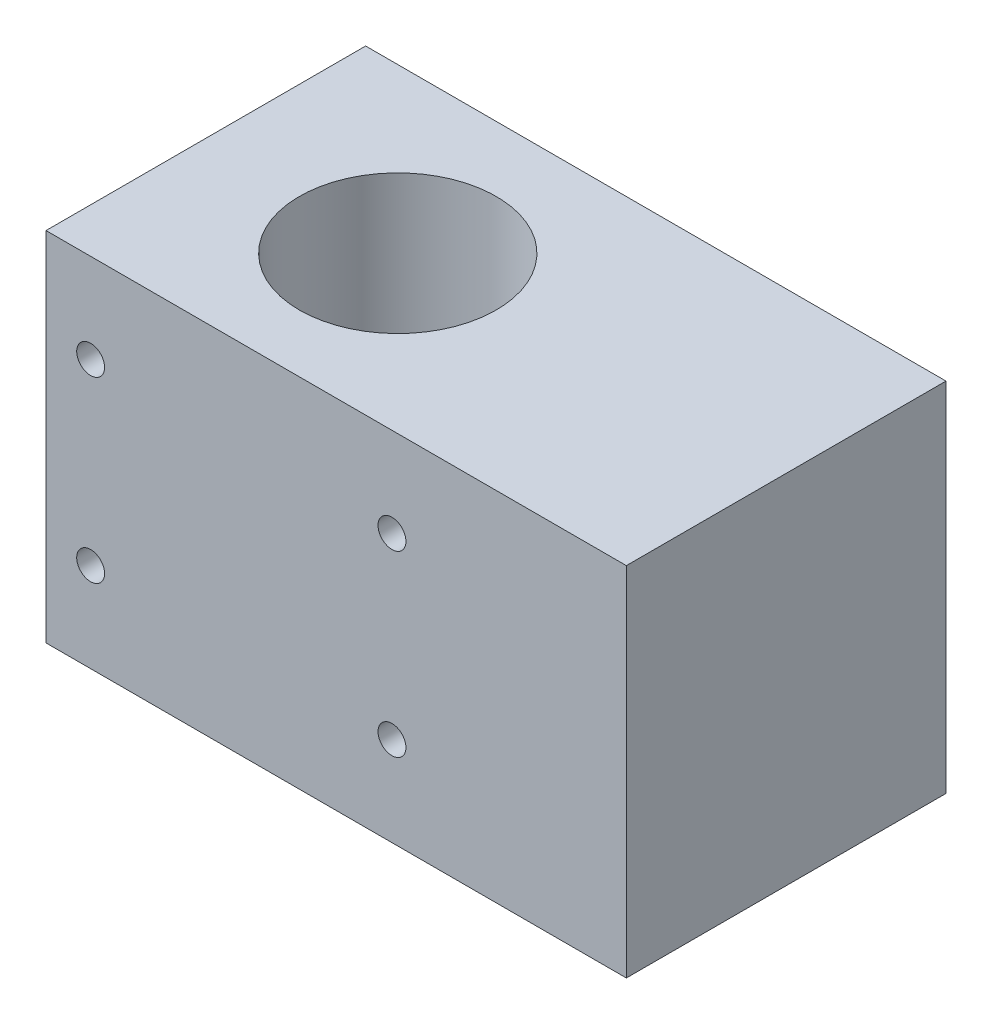
ISO-10303-21;
HEADER;
FILE_DESCRIPTION(('STEP AP214'),'2;1');
FILE_NAME('part.step','',(''),(''),'','','');
FILE_SCHEMA(('AUTOMOTIVE_DESIGN { 1 0 10303 214 1 1 1 1 }'));
ENDSEC;
DATA;
#1=APPLICATION_CONTEXT('core data for automotive mechanical design processes');
#2=APPLICATION_PROTOCOL_DEFINITION('international standard','automotive_design',2000,#1);
#3=PRODUCT_CONTEXT('',#1,'mechanical');
#4=PRODUCT('Part','Part','',(#3));
#5=PRODUCT_RELATED_PRODUCT_CATEGORY('part','',(#4));
#6=PRODUCT_DEFINITION_FORMATION('','',#4);
#7=PRODUCT_DEFINITION_CONTEXT('part definition',#1,'design');
#8=PRODUCT_DEFINITION('design','',#6,#7);
#9=PRODUCT_DEFINITION_SHAPE('','',#8);
#10=(LENGTH_UNIT() NAMED_UNIT(*) SI_UNIT(.MILLI.,.METRE.));
#11=(NAMED_UNIT(*) PLANE_ANGLE_UNIT() SI_UNIT($,.RADIAN.));
#12=(NAMED_UNIT(*) SI_UNIT($,.STERADIAN.) SOLID_ANGLE_UNIT());
#13=UNCERTAINTY_MEASURE_WITH_UNIT(LENGTH_MEASURE(1.E-05),#10,'distance_accuracy_value','');
#14=(GEOMETRIC_REPRESENTATION_CONTEXT(3) GLOBAL_UNCERTAINTY_ASSIGNED_CONTEXT((#13)) GLOBAL_UNIT_ASSIGNED_CONTEXT((#10,
#11,#12)) REPRESENTATION_CONTEXT('',''));
#15=CARTESIAN_POINT('',(0.,0.,0.));
#16=DIRECTION('',(0.,0.,1.));
#17=DIRECTION('',(1.,0.,0.));
#18=AXIS2_PLACEMENT_3D('',#15,#16,#17);
#19=CARTESIAN_POINT('',(82.55,0.,45.466));
#20=DIRECTION('',(0.,1.,0.));
#21=DIRECTION('',(0.,0.,1.));
#22=AXIS2_PLACEMENT_3D('',#19,#20,#21);
#23=PLANE('',#22);
#24=CARTESIAN_POINT('',(74.295,0.,23.241));
#25=DIRECTION('',(0.,-1.,0.));
#26=DIRECTION('',(0.,0.,-1.));
#27=AXIS2_PLACEMENT_3D('',#24,#25,#26);
#28=CIRCLE('',#27,4.21639999999999);
#29=CARTESIAN_POINT('',(74.295,0.,19.0246));
#30=VERTEX_POINT('',#29);
#31=EDGE_CURVE('E119',#30,#30,#28,.T.);
#32=ORIENTED_EDGE('',*,*,#31,.F.);
#33=EDGE_LOOP('',(#32));
#34=FACE_BOUND('',#33,.T.);
#35=CARTESIAN_POINT('',(27.813,0.,23.241));
#36=DIRECTION('',(0.,1.,0.));
#37=DIRECTION('',(0.,0.,1.));
#38=AXIS2_PLACEMENT_3D('',#35,#36,#37);
#39=CIRCLE('',#38,14.);
#40=CARTESIAN_POINT('',(27.813,0.,37.241));
#41=VERTEX_POINT('',#40);
#42=EDGE_CURVE('E172',#41,#41,#39,.T.);
#43=ORIENTED_EDGE('',*,*,#42,.T.);
#44=EDGE_LOOP('',(#43));
#45=FACE_BOUND('',#44,.T.);
#46=DIRECTION('',(1.,0.,0.));
#47=VECTOR('',#46,1.);
#48=CARTESIAN_POINT('',(82.55,0.,0.));
#49=LINE('',#48,#47);
#50=CARTESIAN_POINT('',(0.,0.,0.));
#51=VERTEX_POINT('',#50);
#52=CARTESIAN_POINT('',(82.55,0.,0.));
#53=VERTEX_POINT('',#52);
#54=EDGE_CURVE('E175',#51,#53,#49,.T.);
#55=ORIENTED_EDGE('',*,*,#54,.T.);
#56=DIRECTION('',(0.,0.,-1.));
#57=VECTOR('',#56,1.);
#58=CARTESIAN_POINT('',(82.55,0.,45.466));
#59=LINE('',#58,#57);
#60=CARTESIAN_POINT('',(82.55,0.,45.466));
#61=VERTEX_POINT('',#60);
#62=EDGE_CURVE('E11',#61,#53,#59,.T.);
#63=ORIENTED_EDGE('',*,*,#62,.F.);
#64=DIRECTION('',(1.,0.,0.));
#65=VECTOR('',#64,1.);
#66=CARTESIAN_POINT('',(82.55,0.,45.466));
#67=LINE('',#66,#65);
#68=CARTESIAN_POINT('',(0.,0.,45.466));
#69=VERTEX_POINT('',#68);
#70=EDGE_CURVE('E178',#69,#61,#67,.T.);
#71=ORIENTED_EDGE('',*,*,#70,.F.);
#72=DIRECTION('',(0.,0.,-1.));
#73=VECTOR('',#72,1.);
#74=CARTESIAN_POINT('',(0.,0.,45.466));
#75=LINE('',#74,#73);
#76=EDGE_CURVE('E184',#69,#51,#75,.T.);
#77=ORIENTED_EDGE('',*,*,#76,.T.);
#78=EDGE_LOOP('',(#55,#63,#71,#77));
#79=FACE_BOUND('',#78,.T.);
#80=ADVANCED_FACE('F33',(#34,#45,#79),#23,.F.);
#81=CARTESIAN_POINT('',(82.55,50.8,45.466));
#82=DIRECTION('',(-1.,0.,0.));
#83=DIRECTION('',(0.,0.,1.));
#84=AXIS2_PLACEMENT_3D('',#81,#82,#83);
#85=PLANE('',#84);
#86=DIRECTION('',(0.,1.,0.));
#87=VECTOR('',#86,1.);
#88=CARTESIAN_POINT('',(82.55,50.8,0.));
#89=LINE('',#88,#87);
#90=CARTESIAN_POINT('',(82.55,50.8,0.));
#91=VERTEX_POINT('',#90);
#92=EDGE_CURVE('E187',#53,#91,#89,.T.);
#93=ORIENTED_EDGE('',*,*,#92,.T.);
#94=DIRECTION('',(0.,0.,-1.));
#95=VECTOR('',#94,1.);
#96=CARTESIAN_POINT('',(82.55,50.8,45.466));
#97=LINE('',#96,#95);
#98=CARTESIAN_POINT('',(82.55,50.8,45.466));
#99=VERTEX_POINT('',#98);
#100=EDGE_CURVE('E41',#99,#91,#97,.T.);
#101=ORIENTED_EDGE('',*,*,#100,.F.);
#102=DIRECTION('',(0.,1.,0.));
#103=VECTOR('',#102,1.);
#104=CARTESIAN_POINT('',(82.55,50.8,45.466));
#105=LINE('',#104,#103);
#106=EDGE_CURVE('E80',#61,#99,#105,.T.);
#107=ORIENTED_EDGE('',*,*,#106,.F.);
#108=ORIENTED_EDGE('',*,*,#62,.T.);
#109=EDGE_LOOP('',(#93,#101,#107,#108));
#110=FACE_BOUND('',#109,.T.);
#111=ADVANCED_FACE('F211',(#110),#85,.F.);
#112=CARTESIAN_POINT('',(0.,50.8,45.466));
#113=DIRECTION('',(0.,-1.,0.));
#114=DIRECTION('',(0.,0.,-1.));
#115=AXIS2_PLACEMENT_3D('',#112,#113,#114);
#116=PLANE('',#115);
#117=CARTESIAN_POINT('',(27.813,50.8,23.241));
#118=DIRECTION('',(0.,1.,0.));
#119=DIRECTION('',(0.,0.,1.));
#120=AXIS2_PLACEMENT_3D('',#117,#118,#119);
#121=CIRCLE('',#120,14.);
#122=CARTESIAN_POINT('',(27.813,50.8,37.241));
#123=VERTEX_POINT('',#122);
#124=EDGE_CURVE('E171',#123,#123,#121,.T.);
#125=ORIENTED_EDGE('',*,*,#124,.F.);
#126=EDGE_LOOP('',(#125));
#127=FACE_BOUND('',#126,.T.);
#128=DIRECTION('',(-1.,0.,0.));
#129=VECTOR('',#128,1.);
#130=CARTESIAN_POINT('',(0.,50.8,0.));
#131=LINE('',#130,#129);
#132=CARTESIAN_POINT('',(0.,50.8,0.));
#133=VERTEX_POINT('',#132);
#134=EDGE_CURVE('E67',#91,#133,#131,.T.);
#135=ORIENTED_EDGE('',*,*,#134,.T.);
#136=DIRECTION('',(0.,0.,-1.));
#137=VECTOR('',#136,1.);
#138=CARTESIAN_POINT('',(0.,50.8,45.466));
#139=LINE('',#138,#137);
#140=CARTESIAN_POINT('',(0.,50.8,45.466));
#141=VERTEX_POINT('',#140);
#142=EDGE_CURVE('E192',#141,#133,#139,.T.);
#143=ORIENTED_EDGE('',*,*,#142,.F.);
#144=DIRECTION('',(-1.,0.,0.));
#145=VECTOR('',#144,1.);
#146=CARTESIAN_POINT('',(0.,50.8,45.466));
#147=LINE('',#146,#145);
#148=EDGE_CURVE('E181',#99,#141,#147,.T.);
#149=ORIENTED_EDGE('',*,*,#148,.F.);
#150=ORIENTED_EDGE('',*,*,#100,.T.);
#151=EDGE_LOOP('',(#135,#143,#149,#150));
#152=FACE_BOUND('',#151,.T.);
#153=ADVANCED_FACE('F194',(#127,#152),#116,.F.);
#154=CARTESIAN_POINT('',(0.,0.,45.466));
#155=DIRECTION('',(1.,0.,0.));
#156=DIRECTION('',(0.,0.,-1.));
#157=AXIS2_PLACEMENT_3D('',#154,#155,#156);
#158=PLANE('',#157);
#159=DIRECTION('',(0.,-1.,0.));
#160=VECTOR('',#159,1.);
#161=CARTESIAN_POINT('',(0.,0.,0.));
#162=LINE('',#161,#160);
#163=EDGE_CURVE('E73',#133,#51,#162,.T.);
#164=ORIENTED_EDGE('',*,*,#163,.T.);
#165=ORIENTED_EDGE('',*,*,#76,.F.);
#166=DIRECTION('',(0.,-1.,0.));
#167=VECTOR('',#166,1.);
#168=CARTESIAN_POINT('',(0.,0.,45.466));
#169=LINE('',#168,#167);
#170=EDGE_CURVE('E49',#141,#69,#169,.T.);
#171=ORIENTED_EDGE('',*,*,#170,.F.);
#172=ORIENTED_EDGE('',*,*,#142,.T.);
#173=EDGE_LOOP('',(#164,#165,#171,#172));
#174=FACE_BOUND('',#173,.T.);
#175=ADVANCED_FACE('F201',(#174),#158,.F.);
#176=CARTESIAN_POINT('',(0.,0.,45.466));
#177=DIRECTION('',(0.,0.,-1.));
#178=DIRECTION('',(-1.,0.,0.));
#179=AXIS2_PLACEMENT_3D('',#176,#177,#178);
#180=PLANE('',#179);
#181=CARTESIAN_POINT('',(6.34999999999999,38.1,45.466));
#182=DIRECTION('',(0.,0.,1.));
#183=DIRECTION('',(1.,0.,0.));
#184=AXIS2_PLACEMENT_3D('',#181,#182,#183);
#185=CIRCLE('',#184,1.98437499999999);
#186=CARTESIAN_POINT('',(8.33437499999998,38.1,45.466));
#187=VERTEX_POINT('',#186);
#188=EDGE_CURVE('E147',#187,#187,#185,.T.);
#189=ORIENTED_EDGE('',*,*,#188,.F.);
#190=EDGE_LOOP('',(#189));
#191=FACE_BOUND('',#190,.T.);
#192=CARTESIAN_POINT('',(49.2125,38.1,45.466));
#193=DIRECTION('',(0.,0.,1.));
#194=DIRECTION('',(1.,0.,0.));
#195=AXIS2_PLACEMENT_3D('',#192,#193,#194);
#196=CIRCLE('',#195,1.98437499999999);
#197=CARTESIAN_POINT('',(51.196875,38.1,45.466));
#198=VERTEX_POINT('',#197);
#199=EDGE_CURVE('E153',#198,#198,#196,.T.);
#200=ORIENTED_EDGE('',*,*,#199,.F.);
#201=EDGE_LOOP('',(#200));
#202=FACE_BOUND('',#201,.T.);
#203=CARTESIAN_POINT('',(49.2125,12.7,45.466));
#204=DIRECTION('',(0.,0.,1.));
#205=DIRECTION('',(1.,0.,0.));
#206=AXIS2_PLACEMENT_3D('',#203,#204,#205);
#207=CIRCLE('',#206,1.98437499999999);
#208=CARTESIAN_POINT('',(51.196875,12.7,45.466));
#209=VERTEX_POINT('',#208);
#210=EDGE_CURVE('E159',#209,#209,#207,.T.);
#211=ORIENTED_EDGE('',*,*,#210,.F.);
#212=EDGE_LOOP('',(#211));
#213=FACE_BOUND('',#212,.T.);
#214=CARTESIAN_POINT('',(6.34999999999999,12.7,45.466));
#215=DIRECTION('',(0.,0.,1.));
#216=DIRECTION('',(1.,0.,0.));
#217=AXIS2_PLACEMENT_3D('',#214,#215,#216);
#218=CIRCLE('',#217,1.98437499999999);
#219=CARTESIAN_POINT('',(8.33437499999998,12.7,45.466));
#220=VERTEX_POINT('',#219);
#221=EDGE_CURVE('E165',#220,#220,#218,.T.);
#222=ORIENTED_EDGE('',*,*,#221,.F.);
#223=EDGE_LOOP('',(#222));
#224=FACE_BOUND('',#223,.T.);
#225=ORIENTED_EDGE('',*,*,#70,.T.);
#226=ORIENTED_EDGE('',*,*,#106,.T.);
#227=ORIENTED_EDGE('',*,*,#148,.T.);
#228=ORIENTED_EDGE('',*,*,#170,.T.);
#229=EDGE_LOOP('',(#225,#226,#227,#228));
#230=FACE_BOUND('',#229,.T.);
#231=ADVANCED_FACE('F203',(#191,#202,#213,#224,#230),#180,.F.);
#232=CARTESIAN_POINT('',(0.,0.,0.));
#233=DIRECTION('',(0.,0.,-1.));
#234=DIRECTION('',(-1.,0.,0.));
#235=AXIS2_PLACEMENT_3D('',#232,#233,#234);
#236=PLANE('',#235);
#237=CARTESIAN_POINT('',(6.34999999999999,38.1,0.));
#238=DIRECTION('',(0.,0.,-1.));
#239=DIRECTION('',(-1.,0.,0.));
#240=AXIS2_PLACEMENT_3D('',#237,#238,#239);
#241=CIRCLE('',#240,1.98437499999999);
#242=CARTESIAN_POINT('',(4.365625,38.1,0.));
#243=VERTEX_POINT('',#242);
#244=EDGE_CURVE('E118',#243,#243,#241,.T.);
#245=ORIENTED_EDGE('',*,*,#244,.F.);
#246=EDGE_LOOP('',(#245));
#247=FACE_BOUND('',#246,.T.);
#248=CARTESIAN_POINT('',(49.2125,38.1,0.));
#249=DIRECTION('',(0.,0.,-1.));
#250=DIRECTION('',(-1.,0.,0.));
#251=AXIS2_PLACEMENT_3D('',#248,#249,#250);
#252=CIRCLE('',#251,1.98437499999999);
#253=CARTESIAN_POINT('',(47.228125,38.1,0.));
#254=VERTEX_POINT('',#253);
#255=EDGE_CURVE('E129',#254,#254,#252,.T.);
#256=ORIENTED_EDGE('',*,*,#255,.F.);
#257=EDGE_LOOP('',(#256));
#258=FACE_BOUND('',#257,.T.);
#259=CARTESIAN_POINT('',(49.2125,12.7,0.));
#260=DIRECTION('',(0.,0.,-1.));
#261=DIRECTION('',(-1.,0.,0.));
#262=AXIS2_PLACEMENT_3D('',#259,#260,#261);
#263=CIRCLE('',#262,1.98437499999999);
#264=CARTESIAN_POINT('',(47.228125,12.7,0.));
#265=VERTEX_POINT('',#264);
#266=EDGE_CURVE('E135',#265,#265,#263,.T.);
#267=ORIENTED_EDGE('',*,*,#266,.F.);
#268=EDGE_LOOP('',(#267));
#269=FACE_BOUND('',#268,.T.);
#270=CARTESIAN_POINT('',(6.34999999999999,12.7,0.));
#271=DIRECTION('',(0.,0.,-1.));
#272=DIRECTION('',(-1.,0.,0.));
#273=AXIS2_PLACEMENT_3D('',#270,#271,#272);
#274=CIRCLE('',#273,1.98437499999999);
#275=CARTESIAN_POINT('',(4.365625,12.7,0.));
#276=VERTEX_POINT('',#275);
#277=EDGE_CURVE('E141',#276,#276,#274,.T.);
#278=ORIENTED_EDGE('',*,*,#277,.F.);
#279=EDGE_LOOP('',(#278));
#280=FACE_BOUND('',#279,.T.);
#281=ORIENTED_EDGE('',*,*,#54,.F.);
#282=ORIENTED_EDGE('',*,*,#163,.F.);
#283=ORIENTED_EDGE('',*,*,#134,.F.);
#284=ORIENTED_EDGE('',*,*,#92,.F.);
#285=EDGE_LOOP('',(#281,#282,#283,#284));
#286=FACE_BOUND('',#285,.T.);
#287=ADVANCED_FACE('F197',(#247,#258,#269,#280,#286),#236,.T.);
#288=CARTESIAN_POINT('',(27.813,0.,23.241));
#289=DIRECTION('',(0.,1.,0.));
#290=DIRECTION('',(0.,0.,1.));
#291=AXIS2_PLACEMENT_3D('',#288,#289,#290);
#292=CYLINDRICAL_SURFACE('',#291,14.);
#293=ORIENTED_EDGE('',*,*,#42,.F.);
#294=EDGE_LOOP('',(#293));
#295=FACE_BOUND('',#294,.T.);
#296=ORIENTED_EDGE('',*,*,#124,.T.);
#297=EDGE_LOOP('',(#296));
#298=FACE_BOUND('',#297,.T.);
#299=ADVANCED_FACE('F224',(#295,#298),#292,.F.);
#300=CARTESIAN_POINT('',(6.34999999999999,12.7,32.766));
#301=DIRECTION('',(0.,0.,1.));
#302=DIRECTION('',(1.,0.,0.));
#303=AXIS2_PLACEMENT_3D('',#300,#301,#302);
#304=CONICAL_SURFACE('',#303,1.984375,1.02974425867665);
#305=CARTESIAN_POINT('',(6.34999999999999,12.7,31.5736672091172));
#306=VERTEX_POINT('',#305);
#307=VERTEX_LOOP('',#306);
#308=FACE_BOUND('',#307,.T.);
#309=CARTESIAN_POINT('',(6.34999999999999,12.7,32.766));
#310=DIRECTION('',(0.,0.,1.));
#311=DIRECTION('',(1.,0.,0.));
#312=AXIS2_PLACEMENT_3D('',#309,#310,#311);
#313=CIRCLE('',#312,1.984375);
#314=CARTESIAN_POINT('',(8.33437499999999,12.7,32.766));
#315=VERTEX_POINT('',#314);
#316=EDGE_CURVE('E168',#315,#315,#313,.T.);
#317=ORIENTED_EDGE('',*,*,#316,.T.);
#318=EDGE_LOOP('',(#317));
#319=FACE_BOUND('',#318,.T.);
#320=ADVANCED_FACE('F227',(#308,#319),#304,.F.);
#321=CARTESIAN_POINT('',(6.34999999999999,12.7,45.466));
#322=DIRECTION('',(0.,0.,1.));
#323=DIRECTION('',(1.,0.,0.));
#324=AXIS2_PLACEMENT_3D('',#321,#322,#323);
#325=CYLINDRICAL_SURFACE('',#324,1.98437499999999);
#326=ORIENTED_EDGE('',*,*,#316,.F.);
#327=EDGE_LOOP('',(#326));
#328=FACE_BOUND('',#327,.T.);
#329=ORIENTED_EDGE('',*,*,#221,.T.);
#330=EDGE_LOOP('',(#329));
#331=FACE_BOUND('',#330,.T.);
#332=ADVANCED_FACE('F234',(#328,#331),#325,.F.);
#333=CARTESIAN_POINT('',(49.2125,12.7,32.766));
#334=DIRECTION('',(0.,0.,1.));
#335=DIRECTION('',(1.,0.,0.));
#336=AXIS2_PLACEMENT_3D('',#333,#334,#335);
#337=CONICAL_SURFACE('',#336,1.984375,1.02974425867665);
#338=CARTESIAN_POINT('',(49.2125,12.7,31.5736672091172));
#339=VERTEX_POINT('',#338);
#340=VERTEX_LOOP('',#339);
#341=FACE_BOUND('',#340,.T.);
#342=CARTESIAN_POINT('',(49.2125,12.7,32.766));
#343=DIRECTION('',(0.,0.,1.));
#344=DIRECTION('',(1.,0.,0.));
#345=AXIS2_PLACEMENT_3D('',#342,#343,#344);
#346=CIRCLE('',#345,1.984375);
#347=CARTESIAN_POINT('',(51.196875,12.7,32.766));
#348=VERTEX_POINT('',#347);
#349=EDGE_CURVE('E162',#348,#348,#346,.T.);
#350=ORIENTED_EDGE('',*,*,#349,.T.);
#351=EDGE_LOOP('',(#350));
#352=FACE_BOUND('',#351,.T.);
#353=ADVANCED_FACE('F241',(#341,#352),#337,.F.);
#354=CARTESIAN_POINT('',(49.2125,12.7,45.466));
#355=DIRECTION('',(0.,0.,1.));
#356=DIRECTION('',(1.,0.,0.));
#357=AXIS2_PLACEMENT_3D('',#354,#355,#356);
#358=CYLINDRICAL_SURFACE('',#357,1.98437499999999);
#359=ORIENTED_EDGE('',*,*,#349,.F.);
#360=EDGE_LOOP('',(#359));
#361=FACE_BOUND('',#360,.T.);
#362=ORIENTED_EDGE('',*,*,#210,.T.);
#363=EDGE_LOOP('',(#362));
#364=FACE_BOUND('',#363,.T.);
#365=ADVANCED_FACE('F245',(#361,#364),#358,.F.);
#366=CARTESIAN_POINT('',(49.2125,38.1,32.766));
#367=DIRECTION('',(0.,0.,1.));
#368=DIRECTION('',(1.,0.,0.));
#369=AXIS2_PLACEMENT_3D('',#366,#367,#368);
#370=CONICAL_SURFACE('',#369,1.984375,1.02974425867665);
#371=CARTESIAN_POINT('',(49.2125,38.1,31.5736672091172));
#372=VERTEX_POINT('',#371);
#373=VERTEX_LOOP('',#372);
#374=FACE_BOUND('',#373,.T.);
#375=CARTESIAN_POINT('',(49.2125,38.1,32.766));
#376=DIRECTION('',(0.,0.,1.));
#377=DIRECTION('',(1.,0.,0.));
#378=AXIS2_PLACEMENT_3D('',#375,#376,#377);
#379=CIRCLE('',#378,1.984375);
#380=CARTESIAN_POINT('',(51.196875,38.1,32.766));
#381=VERTEX_POINT('',#380);
#382=EDGE_CURVE('E156',#381,#381,#379,.T.);
#383=ORIENTED_EDGE('',*,*,#382,.T.);
#384=EDGE_LOOP('',(#383));
#385=FACE_BOUND('',#384,.T.);
#386=ADVANCED_FACE('F249',(#374,#385),#370,.F.);
#387=CARTESIAN_POINT('',(49.2125,38.1,45.466));
#388=DIRECTION('',(0.,0.,1.));
#389=DIRECTION('',(1.,0.,0.));
#390=AXIS2_PLACEMENT_3D('',#387,#388,#389);
#391=CYLINDRICAL_SURFACE('',#390,1.98437499999999);
#392=ORIENTED_EDGE('',*,*,#382,.F.);
#393=EDGE_LOOP('',(#392));
#394=FACE_BOUND('',#393,.T.);
#395=ORIENTED_EDGE('',*,*,#199,.T.);
#396=EDGE_LOOP('',(#395));
#397=FACE_BOUND('',#396,.T.);
#398=ADVANCED_FACE('F253',(#394,#397),#391,.F.);
#399=CARTESIAN_POINT('',(6.34999999999999,38.1,32.766));
#400=DIRECTION('',(0.,0.,1.));
#401=DIRECTION('',(1.,0.,0.));
#402=AXIS2_PLACEMENT_3D('',#399,#400,#401);
#403=CONICAL_SURFACE('',#402,1.984375,1.02974425867665);
#404=CARTESIAN_POINT('',(6.34999999999999,38.1,31.5736672091172));
#405=VERTEX_POINT('',#404);
#406=VERTEX_LOOP('',#405);
#407=FACE_BOUND('',#406,.T.);
#408=CARTESIAN_POINT('',(6.34999999999999,38.1,32.766));
#409=DIRECTION('',(0.,0.,1.));
#410=DIRECTION('',(1.,0.,0.));
#411=AXIS2_PLACEMENT_3D('',#408,#409,#410);
#412=CIRCLE('',#411,1.984375);
#413=CARTESIAN_POINT('',(8.33437499999999,38.1,32.766));
#414=VERTEX_POINT('',#413);
#415=EDGE_CURVE('E150',#414,#414,#412,.T.);
#416=ORIENTED_EDGE('',*,*,#415,.T.);
#417=EDGE_LOOP('',(#416));
#418=FACE_BOUND('',#417,.T.);
#419=ADVANCED_FACE('F257',(#407,#418),#403,.F.);
#420=CARTESIAN_POINT('',(6.34999999999999,38.1,45.466));
#421=DIRECTION('',(0.,0.,1.));
#422=DIRECTION('',(1.,0.,0.));
#423=AXIS2_PLACEMENT_3D('',#420,#421,#422);
#424=CYLINDRICAL_SURFACE('',#423,1.98437499999999);
#425=ORIENTED_EDGE('',*,*,#415,.F.);
#426=EDGE_LOOP('',(#425));
#427=FACE_BOUND('',#426,.T.);
#428=ORIENTED_EDGE('',*,*,#188,.T.);
#429=EDGE_LOOP('',(#428));
#430=FACE_BOUND('',#429,.T.);
#431=ADVANCED_FACE('F261',(#427,#430),#424,.F.);
#432=CARTESIAN_POINT('',(6.34999999999999,12.7,12.7));
#433=DIRECTION('',(0.,0.,-1.));
#434=DIRECTION('',(-1.,0.,0.));
#435=AXIS2_PLACEMENT_3D('',#432,#433,#434);
#436=CONICAL_SURFACE('',#435,1.984375,1.02974425867665);
#437=CARTESIAN_POINT('',(6.34999999999999,12.7,13.8923327908828));
#438=VERTEX_POINT('',#437);
#439=VERTEX_LOOP('',#438);
#440=FACE_BOUND('',#439,.T.);
#441=CARTESIAN_POINT('',(6.34999999999999,12.7,12.7));
#442=DIRECTION('',(0.,0.,-1.));
#443=DIRECTION('',(-1.,0.,0.));
#444=AXIS2_PLACEMENT_3D('',#441,#442,#443);
#445=CIRCLE('',#444,1.984375);
#446=CARTESIAN_POINT('',(4.365625,12.7,12.7));
#447=VERTEX_POINT('',#446);
#448=EDGE_CURVE('E144',#447,#447,#445,.T.);
#449=ORIENTED_EDGE('',*,*,#448,.T.);
#450=EDGE_LOOP('',(#449));
#451=FACE_BOUND('',#450,.T.);
#452=ADVANCED_FACE('F265',(#440,#451),#436,.F.);
#453=CARTESIAN_POINT('',(6.34999999999999,12.7,0.));
#454=DIRECTION('',(0.,0.,-1.));
#455=DIRECTION('',(-1.,0.,0.));
#456=AXIS2_PLACEMENT_3D('',#453,#454,#455);
#457=CYLINDRICAL_SURFACE('',#456,1.98437499999999);
#458=ORIENTED_EDGE('',*,*,#448,.F.);
#459=EDGE_LOOP('',(#458));
#460=FACE_BOUND('',#459,.T.);
#461=ORIENTED_EDGE('',*,*,#277,.T.);
#462=EDGE_LOOP('',(#461));
#463=FACE_BOUND('',#462,.T.);
#464=ADVANCED_FACE('F269',(#460,#463),#457,.F.);
#465=CARTESIAN_POINT('',(49.2125,12.7,12.7));
#466=DIRECTION('',(0.,0.,-1.));
#467=DIRECTION('',(-1.,0.,0.));
#468=AXIS2_PLACEMENT_3D('',#465,#466,#467);
#469=CONICAL_SURFACE('',#468,1.984375,1.02974425867665);
#470=CARTESIAN_POINT('',(49.2125,12.7,13.8923327908828));
#471=VERTEX_POINT('',#470);
#472=VERTEX_LOOP('',#471);
#473=FACE_BOUND('',#472,.T.);
#474=CARTESIAN_POINT('',(49.2125,12.7,12.7));
#475=DIRECTION('',(0.,0.,-1.));
#476=DIRECTION('',(-1.,0.,0.));
#477=AXIS2_PLACEMENT_3D('',#474,#475,#476);
#478=CIRCLE('',#477,1.984375);
#479=CARTESIAN_POINT('',(47.228125,12.7,12.7));
#480=VERTEX_POINT('',#479);
#481=EDGE_CURVE('E138',#480,#480,#478,.T.);
#482=ORIENTED_EDGE('',*,*,#481,.T.);
#483=EDGE_LOOP('',(#482));
#484=FACE_BOUND('',#483,.T.);
#485=ADVANCED_FACE('F273',(#473,#484),#469,.F.);
#486=CARTESIAN_POINT('',(49.2125,12.7,0.));
#487=DIRECTION('',(0.,0.,-1.));
#488=DIRECTION('',(-1.,0.,0.));
#489=AXIS2_PLACEMENT_3D('',#486,#487,#488);
#490=CYLINDRICAL_SURFACE('',#489,1.98437499999999);
#491=ORIENTED_EDGE('',*,*,#481,.F.);
#492=EDGE_LOOP('',(#491));
#493=FACE_BOUND('',#492,.T.);
#494=ORIENTED_EDGE('',*,*,#266,.T.);
#495=EDGE_LOOP('',(#494));
#496=FACE_BOUND('',#495,.T.);
#497=ADVANCED_FACE('F277',(#493,#496),#490,.F.);
#498=CARTESIAN_POINT('',(49.2125,38.1,12.7));
#499=DIRECTION('',(0.,0.,-1.));
#500=DIRECTION('',(-1.,0.,0.));
#501=AXIS2_PLACEMENT_3D('',#498,#499,#500);
#502=CONICAL_SURFACE('',#501,1.984375,1.02974425867665);
#503=CARTESIAN_POINT('',(49.2125,38.1,13.8923327908828));
#504=VERTEX_POINT('',#503);
#505=VERTEX_LOOP('',#504);
#506=FACE_BOUND('',#505,.T.);
#507=CARTESIAN_POINT('',(49.2125,38.1,12.7));
#508=DIRECTION('',(0.,0.,-1.));
#509=DIRECTION('',(-1.,0.,0.));
#510=AXIS2_PLACEMENT_3D('',#507,#508,#509);
#511=CIRCLE('',#510,1.984375);
#512=CARTESIAN_POINT('',(47.228125,38.1,12.7));
#513=VERTEX_POINT('',#512);
#514=EDGE_CURVE('E132',#513,#513,#511,.T.);
#515=ORIENTED_EDGE('',*,*,#514,.T.);
#516=EDGE_LOOP('',(#515));
#517=FACE_BOUND('',#516,.T.);
#518=ADVANCED_FACE('F281',(#506,#517),#502,.F.);
#519=CARTESIAN_POINT('',(49.2125,38.1,0.));
#520=DIRECTION('',(0.,0.,-1.));
#521=DIRECTION('',(-1.,0.,0.));
#522=AXIS2_PLACEMENT_3D('',#519,#520,#521);
#523=CYLINDRICAL_SURFACE('',#522,1.98437499999999);
#524=ORIENTED_EDGE('',*,*,#514,.F.);
#525=EDGE_LOOP('',(#524));
#526=FACE_BOUND('',#525,.T.);
#527=ORIENTED_EDGE('',*,*,#255,.T.);
#528=EDGE_LOOP('',(#527));
#529=FACE_BOUND('',#528,.T.);
#530=ADVANCED_FACE('F285',(#526,#529),#523,.F.);
#531=CARTESIAN_POINT('',(6.34999999999999,38.1,12.7));
#532=DIRECTION('',(0.,0.,-1.));
#533=DIRECTION('',(-1.,0.,0.));
#534=AXIS2_PLACEMENT_3D('',#531,#532,#533);
#535=CONICAL_SURFACE('',#534,1.984375,1.02974425867665);
#536=CARTESIAN_POINT('',(6.34999999999999,38.1,13.8923327908828));
#537=VERTEX_POINT('',#536);
#538=VERTEX_LOOP('',#537);
#539=FACE_BOUND('',#538,.T.);
#540=CARTESIAN_POINT('',(6.34999999999999,38.1,12.7));
#541=DIRECTION('',(0.,0.,-1.));
#542=DIRECTION('',(-1.,0.,0.));
#543=AXIS2_PLACEMENT_3D('',#540,#541,#542);
#544=CIRCLE('',#543,1.984375);
#545=CARTESIAN_POINT('',(4.365625,38.1,12.7));
#546=VERTEX_POINT('',#545);
#547=EDGE_CURVE('E122',#546,#546,#544,.T.);
#548=ORIENTED_EDGE('',*,*,#547,.T.);
#549=EDGE_LOOP('',(#548));
#550=FACE_BOUND('',#549,.T.);
#551=ADVANCED_FACE('F289',(#539,#550),#535,.F.);
#552=CARTESIAN_POINT('',(6.34999999999999,38.1,0.));
#553=DIRECTION('',(0.,0.,-1.));
#554=DIRECTION('',(-1.,0.,0.));
#555=AXIS2_PLACEMENT_3D('',#552,#553,#554);
#556=CYLINDRICAL_SURFACE('',#555,1.98437499999999);
#557=ORIENTED_EDGE('',*,*,#547,.F.);
#558=EDGE_LOOP('',(#557));
#559=FACE_BOUND('',#558,.T.);
#560=ORIENTED_EDGE('',*,*,#244,.T.);
#561=EDGE_LOOP('',(#560));
#562=FACE_BOUND('',#561,.T.);
#563=ADVANCED_FACE('F112',(#559,#562),#556,.F.);
#564=CARTESIAN_POINT('',(74.295,31.75,23.241));
#565=DIRECTION('',(0.,-1.,0.));
#566=DIRECTION('',(0.,0.,-1.));
#567=AXIS2_PLACEMENT_3D('',#564,#565,#566);
#568=CONICAL_SURFACE('',#567,4.21639999999999,1.02974425867665);
#569=CARTESIAN_POINT('',(74.295,34.2834687140678,23.241));
#570=VERTEX_POINT('',#569);
#571=VERTEX_LOOP('',#570);
#572=FACE_BOUND('',#571,.T.);
#573=CARTESIAN_POINT('',(74.295,31.75,23.241));
#574=DIRECTION('',(0.,-1.,0.));
#575=DIRECTION('',(0.,0.,-1.));
#576=AXIS2_PLACEMENT_3D('',#573,#574,#575);
#577=CIRCLE('',#576,4.21639999999999);
#578=CARTESIAN_POINT('',(74.295,31.75,19.0246));
#579=VERTEX_POINT('',#578);
#580=EDGE_CURVE('E116',#579,#579,#577,.T.);
#581=ORIENTED_EDGE('',*,*,#580,.T.);
#582=EDGE_LOOP('',(#581));
#583=FACE_BOUND('',#582,.T.);
#584=ADVANCED_FACE('F108',(#572,#583),#568,.F.);
#585=CARTESIAN_POINT('',(74.295,0.,23.241));
#586=DIRECTION('',(0.,-1.,0.));
#587=DIRECTION('',(0.,0.,-1.));
#588=AXIS2_PLACEMENT_3D('',#585,#586,#587);
#589=CYLINDRICAL_SURFACE('',#588,4.21639999999999);
#590=ORIENTED_EDGE('',*,*,#580,.F.);
#591=EDGE_LOOP('',(#590));
#592=FACE_BOUND('',#591,.T.);
#593=ORIENTED_EDGE('',*,*,#31,.T.);
#594=EDGE_LOOP('',(#593));
#595=FACE_BOUND('',#594,.T.);
#596=ADVANCED_FACE('F111',(#592,#595),#589,.F.);
#597=CLOSED_SHELL('',(#80,#111,#153,#175,#231,#287,#299,#320,#332,#353,#365,#386,#398,#419,#431,
#452,#464,#485,#497,#518,#530,#551,#563,#584,#596));
#598=MANIFOLD_SOLID_BREP('B2',#597);
#599=ADVANCED_BREP_SHAPE_REPRESENTATION('',(#18,#598),#14);
#600=SHAPE_DEFINITION_REPRESENTATION(#9,#599);
ENDSEC;
END-ISO-10303-21;
